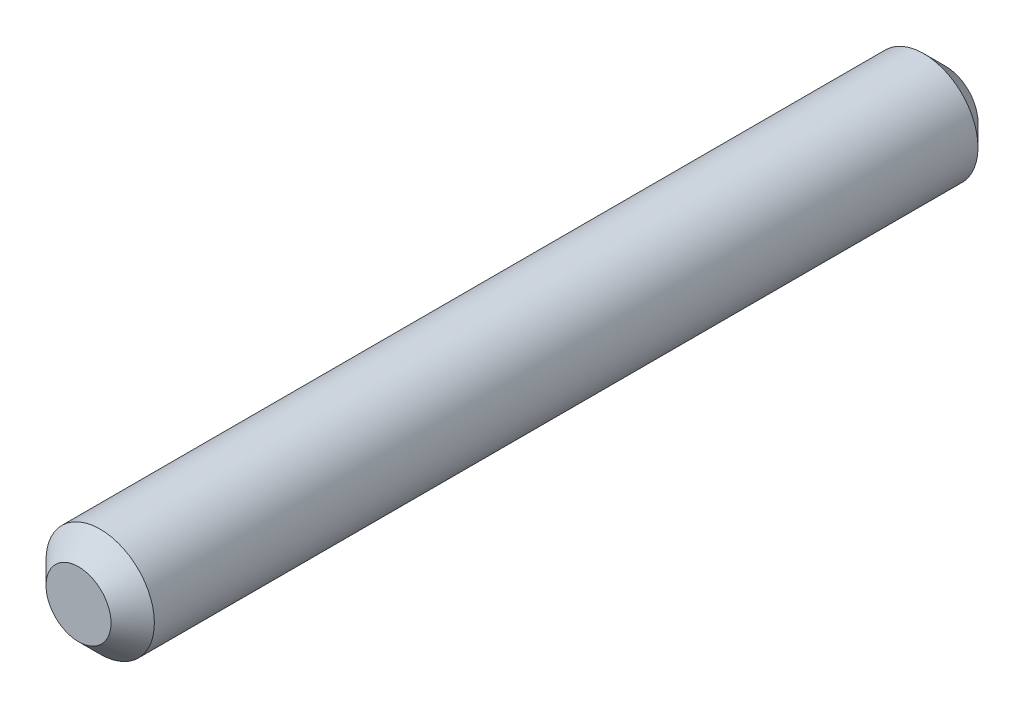
ISO-10303-21;
HEADER;
FILE_DESCRIPTION(('STEP AP214'),'2;1');
FILE_NAME('part.step','',(''),(''),'','','');
FILE_SCHEMA(('AUTOMOTIVE_DESIGN { 1 0 10303 214 1 1 1 1 }'));
ENDSEC;
DATA;
#1=APPLICATION_CONTEXT('core data for automotive mechanical design processes');
#2=APPLICATION_PROTOCOL_DEFINITION('international standard','automotive_design',2000,#1);
#3=PRODUCT_CONTEXT('',#1,'mechanical');
#4=PRODUCT('Part','Part','',(#3));
#5=PRODUCT_RELATED_PRODUCT_CATEGORY('part','',(#4));
#6=PRODUCT_DEFINITION_FORMATION('','',#4);
#7=PRODUCT_DEFINITION_CONTEXT('part definition',#1,'design');
#8=PRODUCT_DEFINITION('design','',#6,#7);
#9=PRODUCT_DEFINITION_SHAPE('','',#8);
#10=(LENGTH_UNIT() NAMED_UNIT(*) SI_UNIT(.MILLI.,.METRE.));
#11=(NAMED_UNIT(*) PLANE_ANGLE_UNIT() SI_UNIT($,.RADIAN.));
#12=(NAMED_UNIT(*) SI_UNIT($,.STERADIAN.) SOLID_ANGLE_UNIT());
#13=UNCERTAINTY_MEASURE_WITH_UNIT(LENGTH_MEASURE(1.E-05),#10,'distance_accuracy_value','');
#14=(GEOMETRIC_REPRESENTATION_CONTEXT(3) GLOBAL_UNCERTAINTY_ASSIGNED_CONTEXT((#13)) GLOBAL_UNIT_ASSIGNED_CONTEXT((#10,
#11,#12)) REPRESENTATION_CONTEXT('',''));
#15=CARTESIAN_POINT('',(0.,0.,0.));
#16=DIRECTION('',(0.,0.,1.));
#17=DIRECTION('',(1.,0.,0.));
#18=AXIS2_PLACEMENT_3D('',#15,#16,#17);
#19=CARTESIAN_POINT('',(0.,0.,50.8));
#20=DIRECTION('',(0.,0.,-1.));
#21=DIRECTION('',(-1.,0.,0.));
#22=AXIS2_PLACEMENT_3D('',#19,#20,#21);
#23=CYLINDRICAL_SURFACE('',#22,3.175);
#24=CARTESIAN_POINT('',(0.,0.,1.27000000000001));
#25=DIRECTION('',(0.,0.,1.));
#26=DIRECTION('',(1.,0.,0.));
#27=AXIS2_PLACEMENT_3D('',#24,#25,#26);
#28=CIRCLE('',#27,3.175);
#29=CARTESIAN_POINT('',(3.175,0.,1.27000000000001));
#30=VERTEX_POINT('',#29);
#31=EDGE_CURVE('E42',#30,#30,#28,.T.);
#32=ORIENTED_EDGE('',*,*,#31,.T.);
#33=EDGE_LOOP('',(#32));
#34=FACE_BOUND('',#33,.T.);
#35=CARTESIAN_POINT('',(0.,0.,49.53));
#36=DIRECTION('',(0.,0.,1.));
#37=DIRECTION('',(1.,0.,0.));
#38=AXIS2_PLACEMENT_3D('',#35,#36,#37);
#39=CIRCLE('',#38,3.175);
#40=CARTESIAN_POINT('',(3.175,0.,49.53));
#41=VERTEX_POINT('',#40);
#42=EDGE_CURVE('E46',#41,#41,#39,.F.);
#43=ORIENTED_EDGE('',*,*,#42,.T.);
#44=EDGE_LOOP('',(#43));
#45=FACE_BOUND('',#44,.T.);
#46=ADVANCED_FACE('F31',(#34,#45),#23,.T.);
#47=CARTESIAN_POINT('',(0.,0.,50.8));
#48=DIRECTION('',(0.,0.,1.));
#49=DIRECTION('',(1.,0.,0.));
#50=AXIS2_PLACEMENT_3D('',#47,#48,#49);
#51=PLANE('',#50);
#52=CARTESIAN_POINT('',(0.,0.,50.8));
#53=DIRECTION('',(0.,0.,1.));
#54=DIRECTION('',(1.,0.,0.));
#55=AXIS2_PLACEMENT_3D('',#52,#53,#54);
#56=CIRCLE('',#55,1.905);
#57=CARTESIAN_POINT('',(1.905,0.,50.8));
#58=VERTEX_POINT('',#57);
#59=EDGE_CURVE('E10',#58,#58,#56,.T.);
#60=ORIENTED_EDGE('',*,*,#59,.T.);
#61=EDGE_LOOP('',(#60));
#62=FACE_BOUND('',#61,.T.);
#63=ADVANCED_FACE('F62',(#62),#51,.T.);
#64=CARTESIAN_POINT('',(0.,0.,0.));
#65=DIRECTION('',(0.,0.,1.));
#66=DIRECTION('',(1.,0.,0.));
#67=AXIS2_PLACEMENT_3D('',#64,#65,#66);
#68=PLANE('',#67);
#69=CARTESIAN_POINT('',(0.,0.,0.));
#70=DIRECTION('',(0.,0.,1.));
#71=DIRECTION('',(1.,0.,0.));
#72=AXIS2_PLACEMENT_3D('',#69,#70,#71);
#73=CIRCLE('',#72,1.90499999999998);
#74=CARTESIAN_POINT('',(1.90499999999998,0.,0.));
#75=VERTEX_POINT('',#74);
#76=EDGE_CURVE('E38',#75,#75,#73,.F.);
#77=ORIENTED_EDGE('',*,*,#76,.T.);
#78=EDGE_LOOP('',(#77));
#79=FACE_BOUND('',#78,.T.);
#80=ADVANCED_FACE('F59',(#79),#68,.F.);
#81=CARTESIAN_POINT('',(0.,0.,1.27000000000001));
#82=DIRECTION('',(0.,0.,1.));
#83=DIRECTION('',(1.,0.,0.));
#84=AXIS2_PLACEMENT_3D('',#81,#82,#83);
#85=CONICAL_SURFACE('',#84,3.175,0.785398163397449);
#86=ORIENTED_EDGE('',*,*,#76,.F.);
#87=EDGE_LOOP('',(#86));
#88=FACE_BOUND('',#87,.T.);
#89=ORIENTED_EDGE('',*,*,#31,.F.);
#90=EDGE_LOOP('',(#89));
#91=FACE_BOUND('',#90,.T.);
#92=ADVANCED_FACE('F55',(#88,#91),#85,.T.);
#93=CARTESIAN_POINT('',(0.,0.,50.8));
#94=DIRECTION('',(0.,0.,-1.));
#95=DIRECTION('',(-1.,0.,0.));
#96=AXIS2_PLACEMENT_3D('',#93,#94,#95);
#97=CONICAL_SURFACE('',#96,1.905,0.785398163397449);
#98=ORIENTED_EDGE('',*,*,#42,.F.);
#99=EDGE_LOOP('',(#98));
#100=FACE_BOUND('',#99,.T.);
#101=ORIENTED_EDGE('',*,*,#59,.F.);
#102=EDGE_LOOP('',(#101));
#103=FACE_BOUND('',#102,.T.);
#104=ADVANCED_FACE('F33',(#100,#103),#97,.T.);
#105=CLOSED_SHELL('',(#46,#63,#80,#92,#104));
#106=MANIFOLD_SOLID_BREP('B2',#105);
#107=ADVANCED_BREP_SHAPE_REPRESENTATION('',(#18,#106),#14);
#108=SHAPE_DEFINITION_REPRESENTATION(#9,#107);
ENDSEC;
END-ISO-10303-21;
